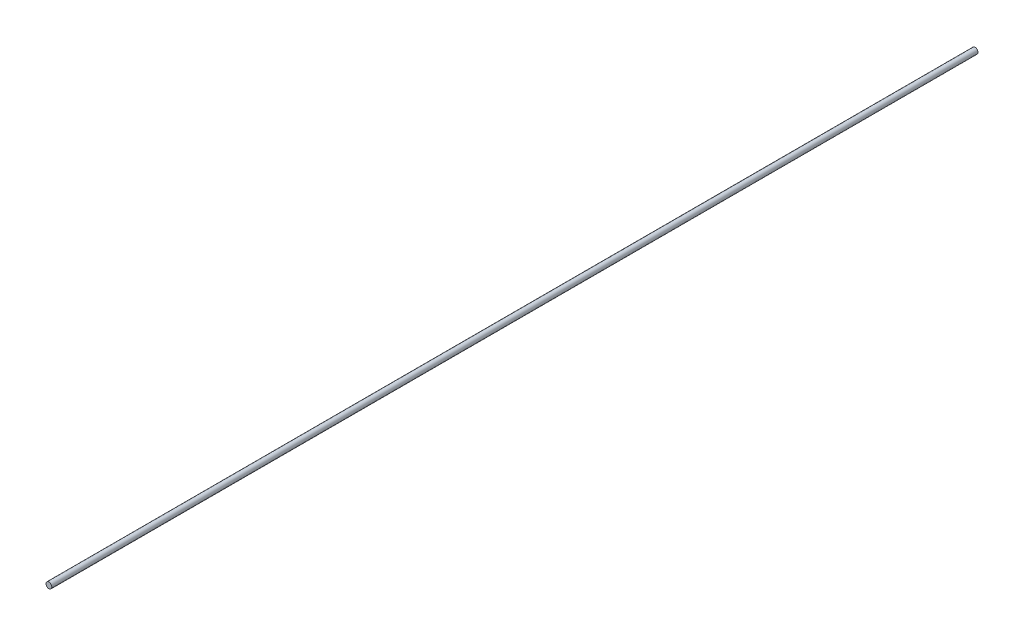
ISO-10303-21;
HEADER;
FILE_DESCRIPTION(('STEP AP214'),'2;1');
FILE_NAME('part.step','',(''),(''),'','','');
FILE_SCHEMA(('AUTOMOTIVE_DESIGN { 1 0 10303 214 1 1 1 1 }'));
ENDSEC;
DATA;
#1=APPLICATION_CONTEXT('core data for automotive mechanical design processes');
#2=APPLICATION_PROTOCOL_DEFINITION('international standard','automotive_design',2000,#1);
#3=PRODUCT_CONTEXT('',#1,'mechanical');
#4=PRODUCT('Part','Part','',(#3));
#5=PRODUCT_RELATED_PRODUCT_CATEGORY('part','',(#4));
#6=PRODUCT_DEFINITION_FORMATION('','',#4);
#7=PRODUCT_DEFINITION_CONTEXT('part definition',#1,'design');
#8=PRODUCT_DEFINITION('design','',#6,#7);
#9=PRODUCT_DEFINITION_SHAPE('','',#8);
#10=(LENGTH_UNIT() NAMED_UNIT(*) SI_UNIT(.MILLI.,.METRE.));
#11=(NAMED_UNIT(*) PLANE_ANGLE_UNIT() SI_UNIT($,.RADIAN.));
#12=(NAMED_UNIT(*) SI_UNIT($,.STERADIAN.) SOLID_ANGLE_UNIT());
#13=UNCERTAINTY_MEASURE_WITH_UNIT(LENGTH_MEASURE(1.E-05),#10,'distance_accuracy_value','');
#14=(GEOMETRIC_REPRESENTATION_CONTEXT(3) GLOBAL_UNCERTAINTY_ASSIGNED_CONTEXT((#13)) GLOBAL_UNIT_ASSIGNED_CONTEXT((#10,
#11,#12)) REPRESENTATION_CONTEXT('',''));
#15=CARTESIAN_POINT('',(0.,0.,0.));
#16=DIRECTION('',(0.,0.,1.));
#17=DIRECTION('',(1.,0.,0.));
#18=AXIS2_PLACEMENT_3D('',#15,#16,#17);
#19=CARTESIAN_POINT('',(0.,0.,956.16));
#20=DIRECTION('',(0.,0.,-1.));
#21=DIRECTION('',(-1.,0.,0.));
#22=AXIS2_PLACEMENT_3D('',#19,#20,#21);
#23=CYLINDRICAL_SURFACE('',#22,3.);
#24=CARTESIAN_POINT('',(0.,0.,956.16));
#25=DIRECTION('',(0.,0.,1.));
#26=DIRECTION('',(1.,0.,0.));
#27=AXIS2_PLACEMENT_3D('',#24,#25,#26);
#28=CIRCLE('',#27,3.);
#29=CARTESIAN_POINT('',(3.,0.,956.16));
#30=VERTEX_POINT('',#29);
#31=EDGE_CURVE('E10',#30,#30,#28,.T.);
#32=ORIENTED_EDGE('',*,*,#31,.F.);
#33=EDGE_LOOP('',(#32));
#34=FACE_BOUND('',#33,.T.);
#35=CARTESIAN_POINT('',(0.,0.,0.));
#36=DIRECTION('',(0.,0.,1.));
#37=DIRECTION('',(1.,0.,0.));
#38=AXIS2_PLACEMENT_3D('',#35,#36,#37);
#39=CIRCLE('',#38,3.);
#40=CARTESIAN_POINT('',(3.,0.,0.));
#41=VERTEX_POINT('',#40);
#42=EDGE_CURVE('E36',#41,#41,#39,.T.);
#43=ORIENTED_EDGE('',*,*,#42,.T.);
#44=EDGE_LOOP('',(#43));
#45=FACE_BOUND('',#44,.T.);
#46=ADVANCED_FACE('F33',(#34,#45),#23,.T.);
#47=CARTESIAN_POINT('',(0.,0.,956.16));
#48=DIRECTION('',(0.,0.,1.));
#49=DIRECTION('',(1.,0.,0.));
#50=AXIS2_PLACEMENT_3D('',#47,#48,#49);
#51=PLANE('',#50);
#52=ORIENTED_EDGE('',*,*,#31,.T.);
#53=EDGE_LOOP('',(#52));
#54=FACE_BOUND('',#53,.T.);
#55=ADVANCED_FACE('F48',(#54),#51,.T.);
#56=CARTESIAN_POINT('',(0.,0.,0.));
#57=DIRECTION('',(0.,0.,1.));
#58=DIRECTION('',(1.,0.,0.));
#59=AXIS2_PLACEMENT_3D('',#56,#57,#58);
#60=PLANE('',#59);
#61=ORIENTED_EDGE('',*,*,#42,.F.);
#62=EDGE_LOOP('',(#61));
#63=FACE_BOUND('',#62,.T.);
#64=ADVANCED_FACE('F46',(#63),#60,.F.);
#65=CLOSED_SHELL('',(#46,#55,#64));
#66=MANIFOLD_SOLID_BREP('B2',#65);
#67=ADVANCED_BREP_SHAPE_REPRESENTATION('',(#18,#66),#14);
#68=SHAPE_DEFINITION_REPRESENTATION(#9,#67);
ENDSEC;
END-ISO-10303-21;
